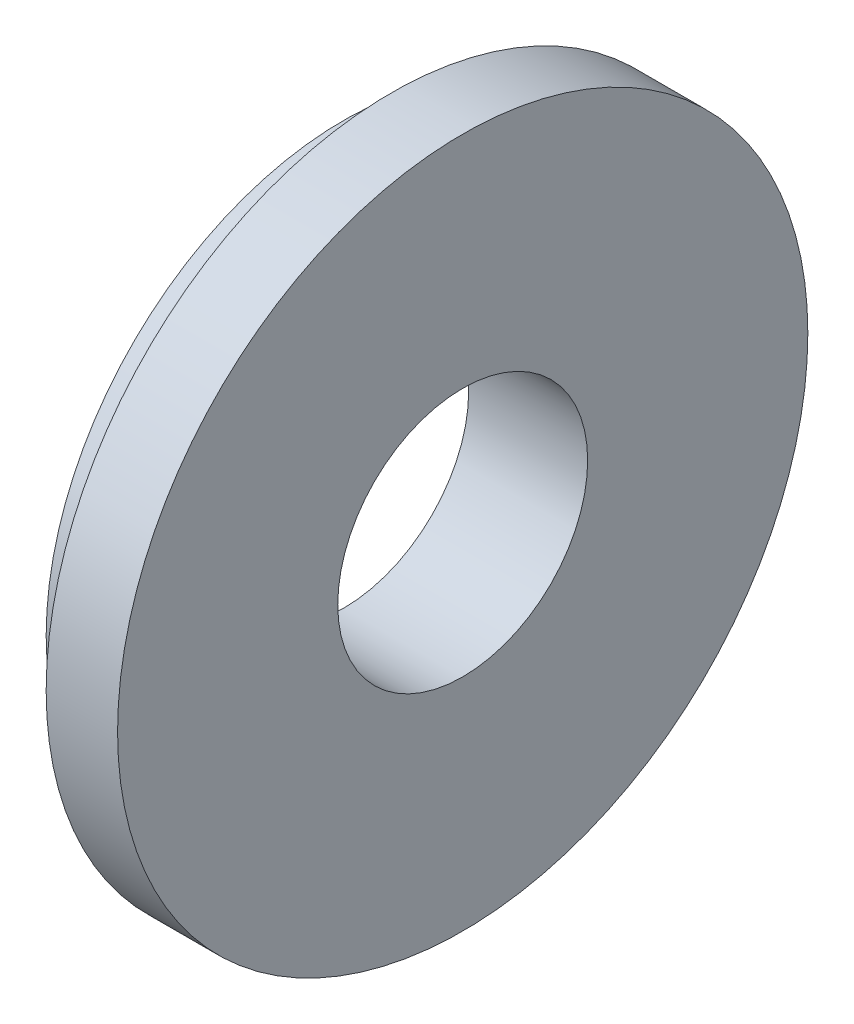
ISO-10303-21;
HEADER;
FILE_DESCRIPTION(('STEP AP214'),'2;1');
FILE_NAME('part.step','',(''),(''),'','','');
FILE_SCHEMA(('AUTOMOTIVE_DESIGN { 1 0 10303 214 1 1 1 1 }'));
ENDSEC;
DATA;
#1=APPLICATION_CONTEXT('core data for automotive mechanical design processes');
#2=APPLICATION_PROTOCOL_DEFINITION('international standard','automotive_design',2000,#1);
#3=PRODUCT_CONTEXT('',#1,'mechanical');
#4=PRODUCT('Part','Part','',(#3));
#5=PRODUCT_RELATED_PRODUCT_CATEGORY('part','',(#4));
#6=PRODUCT_DEFINITION_FORMATION('','',#4);
#7=PRODUCT_DEFINITION_CONTEXT('part definition',#1,'design');
#8=PRODUCT_DEFINITION('design','',#6,#7);
#9=PRODUCT_DEFINITION_SHAPE('','',#8);
#10=(LENGTH_UNIT() NAMED_UNIT(*) SI_UNIT(.MILLI.,.METRE.));
#11=(NAMED_UNIT(*) PLANE_ANGLE_UNIT() SI_UNIT($,.RADIAN.));
#12=(NAMED_UNIT(*) SI_UNIT($,.STERADIAN.) SOLID_ANGLE_UNIT());
#13=UNCERTAINTY_MEASURE_WITH_UNIT(LENGTH_MEASURE(1.E-05),#10,'distance_accuracy_value','');
#14=(GEOMETRIC_REPRESENTATION_CONTEXT(3) GLOBAL_UNCERTAINTY_ASSIGNED_CONTEXT((#13)) GLOBAL_UNIT_ASSIGNED_CONTEXT((#10,
#11,#12)) REPRESENTATION_CONTEXT('',''));
#15=CARTESIAN_POINT('',(0.,0.,0.));
#16=DIRECTION('',(0.,0.,1.));
#17=DIRECTION('',(1.,0.,0.));
#18=AXIS2_PLACEMENT_3D('',#15,#16,#17);
#19=CARTESIAN_POINT('',(0.,0.,0.));
#20=DIRECTION('',(1.,0.,0.));
#21=DIRECTION('',(0.,0.,-1.));
#22=AXIS2_PLACEMENT_3D('',#19,#20,#21);
#23=PLANE('',#22);
#24=CARTESIAN_POINT('',(0.,0.,0.));
#25=DIRECTION('',(1.,0.,0.));
#26=DIRECTION('',(0.,0.,-1.));
#27=AXIS2_PLACEMENT_3D('',#24,#25,#26);
#28=CIRCLE('',#27,5.25);
#29=CARTESIAN_POINT('',(0.,0.,-5.25));
#30=VERTEX_POINT('',#29);
#31=EDGE_CURVE('E51',#30,#30,#28,.T.);
#32=ORIENTED_EDGE('',*,*,#31,.T.);
#33=EDGE_LOOP('',(#32));
#34=FACE_BOUND('',#33,.T.);
#35=CARTESIAN_POINT('',(0.,0.,0.));
#36=DIRECTION('',(-1.,0.,0.));
#37=DIRECTION('',(0.,0.,1.));
#38=AXIS2_PLACEMENT_3D('',#35,#36,#37);
#39=CIRCLE('',#38,12.5);
#40=CARTESIAN_POINT('',(0.,0.,12.5));
#41=VERTEX_POINT('',#40);
#42=EDGE_CURVE('E10',#41,#41,#39,.T.);
#43=ORIENTED_EDGE('',*,*,#42,.T.);
#44=EDGE_LOOP('',(#43));
#45=FACE_BOUND('',#44,.T.);
#46=ADVANCED_FACE('F32',(#34,#45),#23,.F.);
#47=CARTESIAN_POINT('',(-1000.,0.,0.));
#48=DIRECTION('',(-1.,0.,0.));
#49=DIRECTION('',(0.,0.,1.));
#50=AXIS2_PLACEMENT_3D('',#47,#48,#49);
#51=CYLINDRICAL_SURFACE('',#50,12.5);
#52=ORIENTED_EDGE('',*,*,#42,.F.);
#53=EDGE_LOOP('',(#52));
#54=FACE_BOUND('',#53,.T.);
#55=CARTESIAN_POINT('',(2.,0.,0.));
#56=DIRECTION('',(-1.,0.,0.));
#57=DIRECTION('',(0.,0.,1.));
#58=AXIS2_PLACEMENT_3D('',#55,#56,#57);
#59=CIRCLE('',#58,12.5);
#60=CARTESIAN_POINT('',(2.,0.,12.5));
#61=VERTEX_POINT('',#60);
#62=EDGE_CURVE('E38',#61,#61,#59,.T.);
#63=ORIENTED_EDGE('',*,*,#62,.T.);
#64=EDGE_LOOP('',(#63));
#65=FACE_BOUND('',#64,.T.);
#66=ADVANCED_FACE('F79',(#54,#65),#51,.T.);
#67=CARTESIAN_POINT('',(1.99999999999996,12.5,0.));
#68=DIRECTION('',(1.,0.,0.));
#69=DIRECTION('',(0.,0.,-1.));
#70=AXIS2_PLACEMENT_3D('',#67,#68,#69);
#71=PLANE('',#70);
#72=ORIENTED_EDGE('',*,*,#62,.F.);
#73=EDGE_LOOP('',(#72));
#74=FACE_BOUND('',#73,.T.);
#75=CARTESIAN_POINT('',(2.,0.,0.));
#76=DIRECTION('',(-1.,0.,0.));
#77=DIRECTION('',(0.,0.,1.));
#78=AXIS2_PLACEMENT_3D('',#75,#76,#77);
#79=CIRCLE('',#78,14.5);
#80=CARTESIAN_POINT('',(2.,0.,14.5));
#81=VERTEX_POINT('',#80);
#82=EDGE_CURVE('E42',#81,#81,#79,.T.);
#83=ORIENTED_EDGE('',*,*,#82,.T.);
#84=EDGE_LOOP('',(#83));
#85=FACE_BOUND('',#84,.T.);
#86=ADVANCED_FACE('F73',(#74,#85),#71,.F.);
#87=CARTESIAN_POINT('',(-1000.,0.,0.));
#88=DIRECTION('',(-1.,0.,0.));
#89=DIRECTION('',(0.,0.,1.));
#90=AXIS2_PLACEMENT_3D('',#87,#88,#89);
#91=CYLINDRICAL_SURFACE('',#90,14.5);
#92=ORIENTED_EDGE('',*,*,#82,.F.);
#93=EDGE_LOOP('',(#92));
#94=FACE_BOUND('',#93,.T.);
#95=CARTESIAN_POINT('',(4.99999999999989,0.,0.));
#96=DIRECTION('',(-1.,0.,0.));
#97=DIRECTION('',(0.,0.,1.));
#98=AXIS2_PLACEMENT_3D('',#95,#96,#97);
#99=CIRCLE('',#98,14.5);
#100=CARTESIAN_POINT('',(4.99999999999989,0.,14.5));
#101=VERTEX_POINT('',#100);
#102=EDGE_CURVE('E46',#101,#101,#99,.T.);
#103=ORIENTED_EDGE('',*,*,#102,.T.);
#104=EDGE_LOOP('',(#103));
#105=FACE_BOUND('',#104,.T.);
#106=ADVANCED_FACE('F68',(#94,#105),#91,.T.);
#107=CARTESIAN_POINT('',(4.99999999999993,14.5,0.));
#108=DIRECTION('',(-1.,0.,0.));
#109=DIRECTION('',(0.,0.,1.));
#110=AXIS2_PLACEMENT_3D('',#107,#108,#109);
#111=PLANE('',#110);
#112=CARTESIAN_POINT('',(4.99999999999993,0.,0.));
#113=DIRECTION('',(1.,0.,0.));
#114=DIRECTION('',(0.,0.,-1.));
#115=AXIS2_PLACEMENT_3D('',#112,#113,#114);
#116=CIRCLE('',#115,5.25);
#117=CARTESIAN_POINT('',(4.99999999999993,0.,-5.25));
#118=VERTEX_POINT('',#117);
#119=EDGE_CURVE('E52',#118,#118,#116,.T.);
#120=ORIENTED_EDGE('',*,*,#119,.F.);
#121=EDGE_LOOP('',(#120));
#122=FACE_BOUND('',#121,.T.);
#123=ORIENTED_EDGE('',*,*,#102,.F.);
#124=EDGE_LOOP('',(#123));
#125=FACE_BOUND('',#124,.T.);
#126=ADVANCED_FACE('F62',(#122,#125),#111,.F.);
#127=CARTESIAN_POINT('',(0.,0.,0.));
#128=DIRECTION('',(1.,0.,0.));
#129=DIRECTION('',(0.,0.,-1.));
#130=AXIS2_PLACEMENT_3D('',#127,#128,#129);
#131=CYLINDRICAL_SURFACE('',#130,5.25);
#132=ORIENTED_EDGE('',*,*,#31,.F.);
#133=EDGE_LOOP('',(#132));
#134=FACE_BOUND('',#133,.T.);
#135=ORIENTED_EDGE('',*,*,#119,.T.);
#136=EDGE_LOOP('',(#135));
#137=FACE_BOUND('',#136,.T.);
#138=ADVANCED_FACE('F59',(#134,#137),#131,.F.);
#139=CLOSED_SHELL('',(#46,#66,#86,#106,#126,#138));
#140=MANIFOLD_SOLID_BREP('B2',#139);
#141=ADVANCED_BREP_SHAPE_REPRESENTATION('',(#18,#140),#14);
#142=SHAPE_DEFINITION_REPRESENTATION(#9,#141);
ENDSEC;
END-ISO-10303-21;
